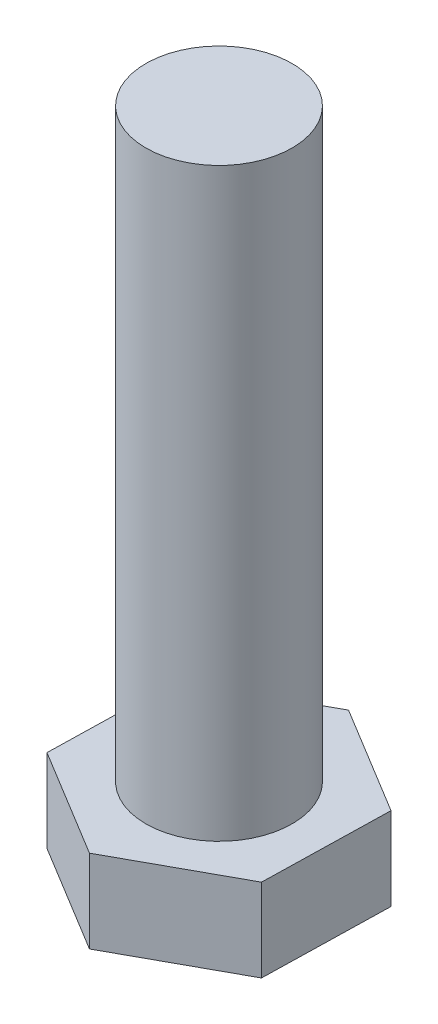
ISO-10303-21;
HEADER;
FILE_DESCRIPTION(('STEP AP214'),'2;1');
FILE_NAME('part.step','',(''),(''),'','','');
FILE_SCHEMA(('AUTOMOTIVE_DESIGN { 1 0 10303 214 1 1 1 1 }'));
ENDSEC;
DATA;
#1=APPLICATION_CONTEXT('core data for automotive mechanical design processes');
#2=APPLICATION_PROTOCOL_DEFINITION('international standard','automotive_design',2000,#1);
#3=PRODUCT_CONTEXT('',#1,'mechanical');
#4=PRODUCT('Part','Part','',(#3));
#5=PRODUCT_RELATED_PRODUCT_CATEGORY('part','',(#4));
#6=PRODUCT_DEFINITION_FORMATION('','',#4);
#7=PRODUCT_DEFINITION_CONTEXT('part definition',#1,'design');
#8=PRODUCT_DEFINITION('design','',#6,#7);
#9=PRODUCT_DEFINITION_SHAPE('','',#8);
#10=(LENGTH_UNIT() NAMED_UNIT(*) SI_UNIT(.MILLI.,.METRE.));
#11=(NAMED_UNIT(*) PLANE_ANGLE_UNIT() SI_UNIT($,.RADIAN.));
#12=(NAMED_UNIT(*) SI_UNIT($,.STERADIAN.) SOLID_ANGLE_UNIT());
#13=UNCERTAINTY_MEASURE_WITH_UNIT(LENGTH_MEASURE(1.E-05),#10,'distance_accuracy_value','');
#14=(GEOMETRIC_REPRESENTATION_CONTEXT(3) GLOBAL_UNCERTAINTY_ASSIGNED_CONTEXT((#13)) GLOBAL_UNIT_ASSIGNED_CONTEXT((#10,
#11,#12)) REPRESENTATION_CONTEXT('',''));
#15=CARTESIAN_POINT('',(0.,0.,0.));
#16=DIRECTION('',(0.,0.,1.));
#17=DIRECTION('',(1.,0.,0.));
#18=AXIS2_PLACEMENT_3D('',#15,#16,#17);
#19=CARTESIAN_POINT('',(0.,12.5,0.));
#20=DIRECTION('',(0.,1.,0.));
#21=DIRECTION('',(0.,0.,1.));
#22=AXIS2_PLACEMENT_3D('',#19,#20,#21);
#23=PLANE('',#22);
#24=DIRECTION('',(0.87704358070201,0.,-0.4804108216406));
#25=VECTOR('',#24,1.);
#26=CARTESIAN_POINT('',(-0.389257886531082,12.5,17.3161334684673));
#27=LINE('',#26,#25);
#28=CARTESIAN_POINT('',(-0.389257886531082,12.5,17.3161334684673));
#29=VERTEX_POINT('',#28);
#30=CARTESIAN_POINT('',(14.8015825357491,12.5,8.99517395259301));
#31=VERTEX_POINT('',#30);
#32=EDGE_CURVE('E118',#29,#31,#27,.T.);
#33=ORIENTED_EDGE('',*,*,#32,.T.);
#34=DIRECTION('',(0.0224738145572903,0.,-0.999747431934308));
#35=VECTOR('',#34,1.);
#36=CARTESIAN_POINT('',(14.8015825357491,12.5,8.99517395259301));
#37=LINE('',#36,#35);
#38=CARTESIAN_POINT('',(15.1908404222802,12.5,-8.32095951587429));
#39=VERTEX_POINT('',#38);
#40=EDGE_CURVE('E107',#31,#39,#37,.T.);
#41=ORIENTED_EDGE('',*,*,#40,.T.);
#42=DIRECTION('',(-0.85456976614472,0.,-0.519336610293708));
#43=VECTOR('',#42,1.);
#44=CARTESIAN_POINT('',(15.1908404222802,12.5,-8.32095951587429));
#45=LINE('',#44,#43);
#46=CARTESIAN_POINT('',(0.38925788653108,12.5,-17.3161334684673));
#47=VERTEX_POINT('',#46);
#48=EDGE_CURVE('E117',#39,#47,#45,.T.);
#49=ORIENTED_EDGE('',*,*,#48,.T.);
#50=DIRECTION('',(-0.87704358070201,0.,0.4804108216406));
#51=VECTOR('',#50,1.);
#52=CARTESIAN_POINT('',(0.38925788653108,12.5,-17.3161334684673));
#53=LINE('',#52,#51);
#54=CARTESIAN_POINT('',(-14.8015825357491,12.5,-8.99517395259301));
#55=VERTEX_POINT('',#54);
#56=EDGE_CURVE('E186',#47,#55,#53,.T.);
#57=ORIENTED_EDGE('',*,*,#56,.T.);
#58=DIRECTION('',(-0.0224738145572905,0.,0.999747431934308));
#59=VECTOR('',#58,1.);
#60=CARTESIAN_POINT('',(-14.8015825357491,12.5,-8.99517395259301));
#61=LINE('',#60,#59);
#62=CARTESIAN_POINT('',(-15.1908404222802,12.5,8.32095951587429));
#63=VERTEX_POINT('',#62);
#64=EDGE_CURVE('E188',#55,#63,#61,.T.);
#65=ORIENTED_EDGE('',*,*,#64,.T.);
#66=DIRECTION('',(0.85456976614472,0.,0.519336610293708));
#67=VECTOR('',#66,1.);
#68=CARTESIAN_POINT('',(-15.1908404222802,12.5,8.32095951587429));
#69=LINE('',#68,#67);
#70=EDGE_CURVE('E123',#63,#29,#69,.T.);
#71=ORIENTED_EDGE('',*,*,#70,.T.);
#72=EDGE_LOOP('',(#33,#41,#49,#57,#65,#71));
#73=FACE_BOUND('',#72,.T.);
#74=CARTESIAN_POINT('',(0.,12.5,0.));
#75=DIRECTION('',(0.,1.,0.));
#76=DIRECTION('',(0.,0.,1.));
#77=AXIS2_PLACEMENT_3D('',#74,#75,#76);
#78=CIRCLE('',#77,10.);
#79=CARTESIAN_POINT('',(0.,12.5,10.));
#80=VERTEX_POINT('',#79);
#81=EDGE_CURVE('E174',#80,#80,#78,.T.);
#82=ORIENTED_EDGE('',*,*,#81,.F.);
#83=EDGE_LOOP('',(#82));
#84=FACE_BOUND('',#83,.T.);
#85=ADVANCED_FACE('F34',(#73,#84),#23,.T.);
#86=CARTESIAN_POINT('',(-0.389257886531082,12.5,17.3161334684673));
#87=DIRECTION('',(-0.4804108216406,0.,-0.87704358070201));
#88=DIRECTION('',(-0.87704358070201,0.,0.4804108216406));
#89=AXIS2_PLACEMENT_3D('',#86,#87,#88);
#90=PLANE('',#89);
#91=DIRECTION('',(0.,-1.,0.));
#92=VECTOR('',#91,1.);
#93=CARTESIAN_POINT('',(-0.389257886531082,12.5,17.3161334684673));
#94=LINE('',#93,#92);
#95=CARTESIAN_POINT('',(-0.389257886531082,1.15470053837925,17.3161334684673));
#96=VERTEX_POINT('',#95);
#97=EDGE_CURVE('E191',#29,#96,#94,.T.);
#98=ORIENTED_EDGE('',*,*,#97,.T.);
#99=DIRECTION('',(0.87704358070201,0.,-0.4804108216406));
#100=VECTOR('',#99,1.);
#101=CARTESIAN_POINT('',(-0.389257886531082,1.15470053837925,17.3161334684673));
#102=LINE('',#101,#100);
#103=CARTESIAN_POINT('',(14.8015825357491,1.15470053837925,8.99517395259301));
#104=VERTEX_POINT('',#103);
#105=EDGE_CURVE('E131',#96,#104,#102,.T.);
#106=ORIENTED_EDGE('',*,*,#105,.T.);
#107=DIRECTION('',(0.,-1.,0.));
#108=VECTOR('',#107,1.);
#109=CARTESIAN_POINT('',(14.8015825357491,12.5,8.99517395259301));
#110=LINE('',#109,#108);
#111=EDGE_CURVE('E111',#31,#104,#110,.T.);
#112=ORIENTED_EDGE('',*,*,#111,.F.);
#113=ORIENTED_EDGE('',*,*,#32,.F.);
#114=EDGE_LOOP('',(#98,#106,#112,#113));
#115=FACE_BOUND('',#114,.T.);
#116=ADVANCED_FACE('F129',(#115),#90,.F.);
#117=CARTESIAN_POINT('',(14.8015825357491,12.5,8.99517395259301));
#118=DIRECTION('',(-0.999747431934308,0.,-0.0224738145572903));
#119=DIRECTION('',(-0.0224738145572903,0.,0.999747431934308));
#120=AXIS2_PLACEMENT_3D('',#117,#118,#119);
#121=PLANE('',#120);
#122=ORIENTED_EDGE('',*,*,#111,.T.);
#123=DIRECTION('',(0.0224738145572903,0.,-0.999747431934308));
#124=VECTOR('',#123,1.);
#125=CARTESIAN_POINT('',(14.8015825357491,1.15470053837925,8.99517395259301));
#126=LINE('',#125,#124);
#127=CARTESIAN_POINT('',(15.1908404222802,1.15470053837925,-8.32095951587429));
#128=VERTEX_POINT('',#127);
#129=EDGE_CURVE('E153',#104,#128,#126,.T.);
#130=ORIENTED_EDGE('',*,*,#129,.T.);
#131=DIRECTION('',(0.,-1.,0.));
#132=VECTOR('',#131,1.);
#133=CARTESIAN_POINT('',(15.1908404222802,12.5,-8.32095951587429));
#134=LINE('',#133,#132);
#135=EDGE_CURVE('E114',#39,#128,#134,.T.);
#136=ORIENTED_EDGE('',*,*,#135,.F.);
#137=ORIENTED_EDGE('',*,*,#40,.F.);
#138=EDGE_LOOP('',(#122,#130,#136,#137));
#139=FACE_BOUND('',#138,.T.);
#140=ADVANCED_FACE('F109',(#139),#121,.F.);
#141=CARTESIAN_POINT('',(15.1908404222802,12.5,-8.32095951587429));
#142=DIRECTION('',(-0.519336610293708,0.,0.85456976614472));
#143=DIRECTION('',(0.85456976614472,0.,0.519336610293708));
#144=AXIS2_PLACEMENT_3D('',#141,#142,#143);
#145=PLANE('',#144);
#146=ORIENTED_EDGE('',*,*,#135,.T.);
#147=DIRECTION('',(-0.85456976614472,0.,-0.519336610293708));
#148=VECTOR('',#147,1.);
#149=CARTESIAN_POINT('',(15.1908404222802,1.15470053837925,-8.32095951587429));
#150=LINE('',#149,#148);
#151=CARTESIAN_POINT('',(0.38925788653108,1.15470053837925,-17.3161334684673));
#152=VERTEX_POINT('',#151);
#153=EDGE_CURVE('E132',#128,#152,#150,.T.);
#154=ORIENTED_EDGE('',*,*,#153,.T.);
#155=DIRECTION('',(0.,-1.,0.));
#156=VECTOR('',#155,1.);
#157=CARTESIAN_POINT('',(0.38925788653108,12.5,-17.3161334684673));
#158=LINE('',#157,#156);
#159=EDGE_CURVE('E137',#47,#152,#158,.T.);
#160=ORIENTED_EDGE('',*,*,#159,.F.);
#161=ORIENTED_EDGE('',*,*,#48,.F.);
#162=EDGE_LOOP('',(#146,#154,#160,#161));
#163=FACE_BOUND('',#162,.T.);
#164=ADVANCED_FACE('F200',(#163),#145,.F.);
#165=CARTESIAN_POINT('',(0.38925788653108,12.5,-17.3161334684673));
#166=DIRECTION('',(0.4804108216406,0.,0.87704358070201));
#167=DIRECTION('',(0.87704358070201,0.,-0.4804108216406));
#168=AXIS2_PLACEMENT_3D('',#165,#166,#167);
#169=PLANE('',#168);
#170=ORIENTED_EDGE('',*,*,#159,.T.);
#171=DIRECTION('',(-0.87704358070201,0.,0.4804108216406));
#172=VECTOR('',#171,1.);
#173=CARTESIAN_POINT('',(0.38925788653108,1.15470053837925,-17.3161334684673));
#174=LINE('',#173,#172);
#175=CARTESIAN_POINT('',(-14.8015825357491,1.15470053837925,-8.99517395259301));
#176=VERTEX_POINT('',#175);
#177=EDGE_CURVE('E11',#152,#176,#174,.T.);
#178=ORIENTED_EDGE('',*,*,#177,.T.);
#179=DIRECTION('',(0.,-1.,0.));
#180=VECTOR('',#179,1.);
#181=CARTESIAN_POINT('',(-14.8015825357491,12.5,-8.99517395259301));
#182=LINE('',#181,#180);
#183=EDGE_CURVE('E195',#55,#176,#182,.T.);
#184=ORIENTED_EDGE('',*,*,#183,.F.);
#185=ORIENTED_EDGE('',*,*,#56,.F.);
#186=EDGE_LOOP('',(#170,#178,#184,#185));
#187=FACE_BOUND('',#186,.T.);
#188=ADVANCED_FACE('F198',(#187),#169,.F.);
#189=CARTESIAN_POINT('',(-14.8015825357491,12.5,-8.99517395259301));
#190=DIRECTION('',(0.999747431934308,0.,0.0224738145572905));
#191=DIRECTION('',(0.0224738145572905,0.,-0.999747431934308));
#192=AXIS2_PLACEMENT_3D('',#189,#190,#191);
#193=PLANE('',#192);
#194=ORIENTED_EDGE('',*,*,#183,.T.);
#195=DIRECTION('',(-0.0224738145572905,0.,0.999747431934308));
#196=VECTOR('',#195,1.);
#197=CARTESIAN_POINT('',(-14.8015825357491,1.15470053837925,-8.99517395259301));
#198=LINE('',#197,#196);
#199=CARTESIAN_POINT('',(-15.1908404222802,1.15470053837925,8.32095951587429));
#200=VERTEX_POINT('',#199);
#201=EDGE_CURVE('E43',#176,#200,#198,.T.);
#202=ORIENTED_EDGE('',*,*,#201,.T.);
#203=DIRECTION('',(0.,-1.,0.));
#204=VECTOR('',#203,1.);
#205=CARTESIAN_POINT('',(-15.1908404222802,12.5,8.32095951587429));
#206=LINE('',#205,#204);
#207=EDGE_CURVE('E193',#63,#200,#206,.T.);
#208=ORIENTED_EDGE('',*,*,#207,.F.);
#209=ORIENTED_EDGE('',*,*,#64,.F.);
#210=EDGE_LOOP('',(#194,#202,#208,#209));
#211=FACE_BOUND('',#210,.T.);
#212=ADVANCED_FACE('F221',(#211),#193,.F.);
#213=CARTESIAN_POINT('',(-15.1908404222802,12.5,8.32095951587429));
#214=DIRECTION('',(0.519336610293708,0.,-0.85456976614472));
#215=DIRECTION('',(-0.85456976614472,0.,-0.519336610293708));
#216=AXIS2_PLACEMENT_3D('',#213,#214,#215);
#217=PLANE('',#216);
#218=ORIENTED_EDGE('',*,*,#207,.T.);
#219=DIRECTION('',(0.85456976614472,0.,0.519336610293708));
#220=VECTOR('',#219,1.);
#221=CARTESIAN_POINT('',(-15.1908404222802,1.15470053837925,8.32095951587429));
#222=LINE('',#221,#220);
#223=EDGE_CURVE('E156',#200,#96,#222,.T.);
#224=ORIENTED_EDGE('',*,*,#223,.T.);
#225=ORIENTED_EDGE('',*,*,#97,.F.);
#226=ORIENTED_EDGE('',*,*,#70,.F.);
#227=EDGE_LOOP('',(#218,#224,#225,#226));
#228=FACE_BOUND('',#227,.T.);
#229=ADVANCED_FACE('F219',(#228),#217,.F.);
#230=CARTESIAN_POINT('',(0.,0.,0.));
#231=DIRECTION('',(0.,1.,0.));
#232=DIRECTION('',(0.,0.,1.));
#233=AXIS2_PLACEMENT_3D('',#230,#231,#232);
#234=PLANE('',#233);
#235=DIRECTION('',(0.87704358070201,0.,-0.4804108216406));
#236=VECTOR('',#235,1.);
#237=CARTESIAN_POINT('',(-6.24534068132779,0.,-11.4015665491261));
#238=LINE('',#237,#236);
#239=CARTESIAN_POINT('',(-12.8280381976492,0.,-7.7958174255806));
#240=VERTEX_POINT('',#239);
#241=CARTESIAN_POINT('',(0.337356834993604,0.,-15.0073156726716));
#242=VERTEX_POINT('',#241);
#243=EDGE_CURVE('E135',#240,#242,#238,.T.);
#244=ORIENTED_EDGE('',*,*,#243,.T.);
#245=DIRECTION('',(0.85456976614472,0.,0.519336610293708));
#246=VECTOR('',#245,1.);
#247=CARTESIAN_POINT('',(6.7513759338182,0.,-11.1094069598813));
#248=LINE('',#247,#246);
#249=CARTESIAN_POINT('',(13.1653950326428,0.,-7.21149824709105));
#250=VERTEX_POINT('',#249);
#251=EDGE_CURVE('E150',#242,#250,#248,.T.);
#252=ORIENTED_EDGE('',*,*,#251,.T.);
#253=DIRECTION('',(-0.0224738145572903,0.,0.999747431934308));
#254=VECTOR('',#253,1.);
#255=CARTESIAN_POINT('',(12.996716615146,0.,0.292159589244773));
#256=LINE('',#255,#254);
#257=CARTESIAN_POINT('',(12.8280381976492,0.,7.7958174255806));
#258=VERTEX_POINT('',#257);
#259=EDGE_CURVE('E148',#250,#258,#256,.T.);
#260=ORIENTED_EDGE('',*,*,#259,.T.);
#261=DIRECTION('',(-0.87704358070201,0.,0.4804108216406));
#262=VECTOR('',#261,1.);
#263=CARTESIAN_POINT('',(6.2453406813278,0.,11.4015665491261));
#264=LINE('',#263,#262);
#265=CARTESIAN_POINT('',(-0.337356834993605,0.,15.0073156726716));
#266=VERTEX_POINT('',#265);
#267=EDGE_CURVE('E146',#258,#266,#264,.T.);
#268=ORIENTED_EDGE('',*,*,#267,.T.);
#269=DIRECTION('',(-0.85456976614472,0.,-0.519336610293708));
#270=VECTOR('',#269,1.);
#271=CARTESIAN_POINT('',(-6.7513759338182,0.,11.1094069598813));
#272=LINE('',#271,#270);
#273=CARTESIAN_POINT('',(-13.1653950326428,0.,7.21149824709105));
#274=VERTEX_POINT('',#273);
#275=EDGE_CURVE('E144',#266,#274,#272,.T.);
#276=ORIENTED_EDGE('',*,*,#275,.T.);
#277=DIRECTION('',(0.0224738145572905,0.,-0.999747431934308));
#278=VECTOR('',#277,1.);
#279=CARTESIAN_POINT('',(-12.996716615146,0.,-0.292159589244776));
#280=LINE('',#279,#278);
#281=EDGE_CURVE('E142',#274,#240,#280,.T.);
#282=ORIENTED_EDGE('',*,*,#281,.T.);
#283=EDGE_LOOP('',(#244,#252,#260,#268,#276,#282));
#284=FACE_BOUND('',#283,.T.);
#285=ADVANCED_FACE('F214',(#284),#234,.F.);
#286=CARTESIAN_POINT('',(0.,92.5,0.));
#287=DIRECTION('',(0.,-1.,0.));
#288=DIRECTION('',(0.,0.,-1.));
#289=AXIS2_PLACEMENT_3D('',#286,#287,#288);
#290=CYLINDRICAL_SURFACE('',#289,10.);
#291=CARTESIAN_POINT('',(0.,92.5,0.));
#292=DIRECTION('',(0.,1.,0.));
#293=DIRECTION('',(0.,0.,1.));
#294=AXIS2_PLACEMENT_3D('',#291,#292,#293);
#295=CIRCLE('',#294,10.);
#296=CARTESIAN_POINT('',(0.,92.5,10.));
#297=VERTEX_POINT('',#296);
#298=EDGE_CURVE('E127',#297,#297,#295,.T.);
#299=ORIENTED_EDGE('',*,*,#298,.F.);
#300=EDGE_LOOP('',(#299));
#301=FACE_BOUND('',#300,.T.);
#302=ORIENTED_EDGE('',*,*,#81,.T.);
#303=EDGE_LOOP('',(#302));
#304=FACE_BOUND('',#303,.T.);
#305=ADVANCED_FACE('F238',(#301,#304),#290,.T.);
#306=CARTESIAN_POINT('',(0.,92.5,0.));
#307=DIRECTION('',(0.,1.,0.));
#308=DIRECTION('',(0.,0.,1.));
#309=AXIS2_PLACEMENT_3D('',#306,#307,#308);
#310=PLANE('',#309);
#311=ORIENTED_EDGE('',*,*,#298,.T.);
#312=EDGE_LOOP('',(#311));
#313=FACE_BOUND('',#312,.T.);
#314=ADVANCED_FACE('F244',(#313),#310,.T.);
#315=CARTESIAN_POINT('',(-15.1908404222802,1.15470053837925,8.32095951587429));
#316=DIRECTION('',(0.259668305146853,0.86602540378444,-0.427284883072358));
#317=DIRECTION('',(0.85456976614472,0.,0.519336610293708));
#318=AXIS2_PLACEMENT_3D('',#315,#316,#317);
#319=PLANE('',#318);
#320=DIRECTION('',(-0.784451626271808,0.447213595499956,0.429692501725963));
#321=VECTOR('',#320,1.);
#322=CARTESIAN_POINT('',(-9.1145042533681,-2.30940107675848,4.99257570952458));
#323=LINE('',#322,#321);
#324=EDGE_CURVE('E168',#274,#200,#323,.T.);
#325=ORIENTED_EDGE('',*,*,#324,.F.);
#326=ORIENTED_EDGE('',*,*,#275,.F.);
#327=DIRECTION('',(-0.0201011908255296,0.447213595499956,0.894201287254384));
#328=VECTOR('',#327,1.);
#329=CARTESIAN_POINT('',(-0.233554731918655,-2.3094010767585,10.3896800810804));
#330=LINE('',#329,#328);
#331=EDGE_CURVE('E38',#96,#266,#330,.F.);
#332=ORIENTED_EDGE('',*,*,#331,.F.);
#333=ORIENTED_EDGE('',*,*,#223,.F.);
#334=EDGE_LOOP('',(#325,#326,#332,#333));
#335=FACE_BOUND('',#334,.T.);
#336=ADVANCED_FACE('F36',(#335),#319,.F.);
#337=CARTESIAN_POINT('',(-0.389257886531082,1.15470053837925,17.3161334684673));
#338=DIRECTION('',(-0.240205410820299,0.86602540378444,-0.438521790351003));
#339=DIRECTION('',(0.87704358070201,0.,-0.4804108216406));
#340=AXIS2_PLACEMENT_3D('',#337,#338,#339);
#341=PLANE('',#340);
#342=ORIENTED_EDGE('',*,*,#331,.T.);
#343=ORIENTED_EDGE('',*,*,#267,.F.);
#344=DIRECTION('',(0.764350435446278,0.447213595499956,0.464508785528419));
#345=VECTOR('',#344,1.);
#346=CARTESIAN_POINT('',(8.88094952144943,-2.30940107675849,5.3971043715558));
#347=LINE('',#346,#345);
#348=EDGE_CURVE('E166',#104,#258,#347,.F.);
#349=ORIENTED_EDGE('',*,*,#348,.F.);
#350=ORIENTED_EDGE('',*,*,#105,.F.);
#351=EDGE_LOOP('',(#342,#343,#349,#350));
#352=FACE_BOUND('',#351,.T.);
#353=ADVANCED_FACE('F254',(#352),#341,.F.);
#354=CARTESIAN_POINT('',(-14.8015825357491,1.15470053837925,-8.99517395259301));
#355=DIRECTION('',(0.499873715967152,0.86602540378444,0.0112369072786452));
#356=DIRECTION('',(-0.0224738145572905,0.,0.999747431934308));
#357=AXIS2_PLACEMENT_3D('',#354,#355,#356);
#358=PLANE('',#357);
#359=ORIENTED_EDGE('',*,*,#324,.T.);
#360=ORIENTED_EDGE('',*,*,#201,.F.);
#361=DIRECTION('',(-0.764350435446278,0.447213595499956,-0.46450878552842));
#362=VECTOR('',#361,1.);
#363=CARTESIAN_POINT('',(-8.88094952144943,-2.30940107675849,-5.39710437155579));
#364=LINE('',#363,#362);
#365=EDGE_CURVE('E163',#240,#176,#364,.T.);
#366=ORIENTED_EDGE('',*,*,#365,.F.);
#367=ORIENTED_EDGE('',*,*,#281,.F.);
#368=EDGE_LOOP('',(#359,#360,#366,#367));
#369=FACE_BOUND('',#368,.T.);
#370=ADVANCED_FACE('F212',(#369),#358,.F.);
#371=CARTESIAN_POINT('',(14.8015825357491,1.15470053837925,8.99517395259301));
#372=DIRECTION('',(-0.499873715967152,0.86602540378444,-0.0112369072786451));
#373=DIRECTION('',(0.0224738145572903,0.,-0.999747431934308));
#374=AXIS2_PLACEMENT_3D('',#371,#372,#373);
#375=PLANE('',#374);
#376=ORIENTED_EDGE('',*,*,#348,.T.);
#377=ORIENTED_EDGE('',*,*,#259,.F.);
#378=DIRECTION('',(0.784451626271808,0.447213595499956,-0.429692501725963));
#379=VECTOR('',#378,1.);
#380=CARTESIAN_POINT('',(9.1145042533681,-2.30940107675848,-4.99257570952459));
#381=LINE('',#380,#379);
#382=EDGE_CURVE('E161',#128,#250,#381,.F.);
#383=ORIENTED_EDGE('',*,*,#382,.F.);
#384=ORIENTED_EDGE('',*,*,#129,.F.);
#385=EDGE_LOOP('',(#376,#377,#383,#384));
#386=FACE_BOUND('',#385,.T.);
#387=ADVANCED_FACE('F261',(#386),#375,.F.);
#388=CARTESIAN_POINT('',(0.38925788653108,1.15470053837925,-17.3161334684673));
#389=DIRECTION('',(0.240205410820299,0.86602540378444,0.438521790351003));
#390=DIRECTION('',(-0.87704358070201,0.,0.4804108216406));
#391=AXIS2_PLACEMENT_3D('',#388,#389,#390);
#392=PLANE('',#391);
#393=ORIENTED_EDGE('',*,*,#365,.T.);
#394=ORIENTED_EDGE('',*,*,#177,.F.);
#395=DIRECTION('',(-0.0201011908255292,-0.447213595499956,0.894201287254384));
#396=VECTOR('',#395,1.);
#397=CARTESIAN_POINT('',(0.389257886531079,1.15470053837925,-17.3161334684673));
#398=LINE('',#397,#396);
#399=EDGE_CURVE('E159',#242,#152,#398,.F.);
#400=ORIENTED_EDGE('',*,*,#399,.F.);
#401=ORIENTED_EDGE('',*,*,#243,.F.);
#402=EDGE_LOOP('',(#393,#394,#400,#401));
#403=FACE_BOUND('',#402,.T.);
#404=ADVANCED_FACE('F210',(#403),#392,.F.);
#405=CARTESIAN_POINT('',(15.1908404222802,1.15470053837925,-8.32095951587429));
#406=DIRECTION('',(-0.259668305146853,0.866025403784439,0.427284883072359));
#407=DIRECTION('',(-0.85456976614472,0.,-0.519336610293708));
#408=AXIS2_PLACEMENT_3D('',#405,#406,#407);
#409=PLANE('',#408);
#410=ORIENTED_EDGE('',*,*,#382,.T.);
#411=ORIENTED_EDGE('',*,*,#251,.F.);
#412=ORIENTED_EDGE('',*,*,#399,.T.);
#413=ORIENTED_EDGE('',*,*,#153,.F.);
#414=EDGE_LOOP('',(#410,#411,#412,#413));
#415=FACE_BOUND('',#414,.T.);
#416=ADVANCED_FACE('F204',(#415),#409,.F.);
#417=CLOSED_SHELL('',(#85,#116,#140,#164,#188,#212,#229,#285,#305,#314,#336,#353,#370,#387,#404,#416));
#418=MANIFOLD_SOLID_BREP('B2',#417);
#419=ADVANCED_BREP_SHAPE_REPRESENTATION('',(#18,#418),#14);
#420=SHAPE_DEFINITION_REPRESENTATION(#9,#419);
ENDSEC;
END-ISO-10303-21;
